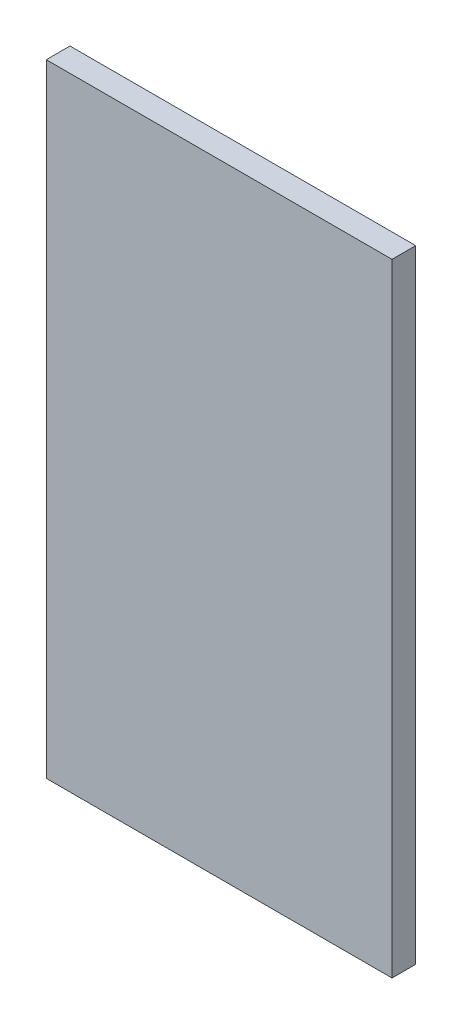
ISO-10303-21;
HEADER;
FILE_DESCRIPTION(('STEP AP214'),'2;1');
FILE_NAME('part.step','',(''),(''),'','','');
FILE_SCHEMA(('AUTOMOTIVE_DESIGN { 1 0 10303 214 1 1 1 1 }'));
ENDSEC;
DATA;
#1=APPLICATION_CONTEXT('core data for automotive mechanical design processes');
#2=APPLICATION_PROTOCOL_DEFINITION('international standard','automotive_design',2000,#1);
#3=PRODUCT_CONTEXT('',#1,'mechanical');
#4=PRODUCT('Part','Part','',(#3));
#5=PRODUCT_RELATED_PRODUCT_CATEGORY('part','',(#4));
#6=PRODUCT_DEFINITION_FORMATION('','',#4);
#7=PRODUCT_DEFINITION_CONTEXT('part definition',#1,'design');
#8=PRODUCT_DEFINITION('design','',#6,#7);
#9=PRODUCT_DEFINITION_SHAPE('','',#8);
#10=(LENGTH_UNIT() NAMED_UNIT(*) SI_UNIT(.MILLI.,.METRE.));
#11=(NAMED_UNIT(*) PLANE_ANGLE_UNIT() SI_UNIT($,.RADIAN.));
#12=(NAMED_UNIT(*) SI_UNIT($,.STERADIAN.) SOLID_ANGLE_UNIT());
#13=UNCERTAINTY_MEASURE_WITH_UNIT(LENGTH_MEASURE(1.E-05),#10,'distance_accuracy_value','');
#14=(GEOMETRIC_REPRESENTATION_CONTEXT(3) GLOBAL_UNCERTAINTY_ASSIGNED_CONTEXT((#13)) GLOBAL_UNIT_ASSIGNED_CONTEXT((#10,
#11,#12)) REPRESENTATION_CONTEXT('',''));
#15=CARTESIAN_POINT('',(0.,0.,0.));
#16=DIRECTION('',(0.,0.,1.));
#17=DIRECTION('',(1.,0.,0.));
#18=AXIS2_PLACEMENT_3D('',#15,#16,#17);
#19=CARTESIAN_POINT('',(9.80008,0.7,0.));
#20=DIRECTION('',(0.,0.,-1.));
#21=DIRECTION('',(-1.,0.,0.));
#22=AXIS2_PLACEMENT_3D('',#19,#20,#21);
#23=PLANE('',#22);
#24=DIRECTION('',(1.,0.,0.));
#25=VECTOR('',#24,1.);
#26=CARTESIAN_POINT('',(9.55008,1.15,0.));
#27=LINE('',#26,#25);
#28=CARTESIAN_POINT('',(9.55008,1.15,0.));
#29=VERTEX_POINT('',#28);
#30=CARTESIAN_POINT('',(10.05008,1.15,0.));
#31=VERTEX_POINT('',#30);
#32=EDGE_CURVE('E55',#29,#31,#27,.T.);
#33=ORIENTED_EDGE('',*,*,#32,.T.);
#34=DIRECTION('',(0.,1.,0.));
#35=VECTOR('',#34,1.);
#36=CARTESIAN_POINT('',(10.05008,1.15,0.));
#37=LINE('',#36,#35);
#38=CARTESIAN_POINT('',(10.05008,0.25,0.));
#39=VERTEX_POINT('',#38);
#40=EDGE_CURVE('E57',#31,#39,#37,.F.);
#41=ORIENTED_EDGE('',*,*,#40,.T.);
#42=DIRECTION('',(1.,0.,0.));
#43=VECTOR('',#42,1.);
#44=CARTESIAN_POINT('',(10.05008,0.25,0.));
#45=LINE('',#44,#43);
#46=CARTESIAN_POINT('',(9.55008,0.25,0.));
#47=VERTEX_POINT('',#46);
#48=EDGE_CURVE('E20',#39,#47,#45,.F.);
#49=ORIENTED_EDGE('',*,*,#48,.T.);
#50=DIRECTION('',(0.,1.,0.));
#51=VECTOR('',#50,1.);
#52=CARTESIAN_POINT('',(9.55008,0.25,0.));
#53=LINE('',#52,#51);
#54=EDGE_CURVE('E80',#47,#29,#53,.T.);
#55=ORIENTED_EDGE('',*,*,#54,.T.);
#56=EDGE_LOOP('',(#33,#41,#49,#55));
#57=FACE_BOUND('',#56,.T.);
#58=ADVANCED_FACE('F17',(#57),#23,.T.);
#59=CARTESIAN_POINT('',(10.05008,0.25,0.));
#60=DIRECTION('',(0.,1.,0.));
#61=DIRECTION('',(0.,0.,1.));
#62=AXIS2_PLACEMENT_3D('',#59,#60,#61);
#63=PLANE('',#62);
#64=DIRECTION('',(0.,0.,-1.));
#65=VECTOR('',#64,1.);
#66=CARTESIAN_POINT('',(9.55008,0.25,0.));
#67=LINE('',#66,#65);
#68=CARTESIAN_POINT('',(9.55008,0.25,0.03429));
#69=VERTEX_POINT('',#68);
#70=EDGE_CURVE('E68',#69,#47,#67,.T.);
#71=ORIENTED_EDGE('',*,*,#70,.T.);
#72=ORIENTED_EDGE('',*,*,#48,.F.);
#73=DIRECTION('',(0.,0.,1.));
#74=VECTOR('',#73,1.);
#75=CARTESIAN_POINT('',(10.05008,0.25,0.));
#76=LINE('',#75,#74);
#77=CARTESIAN_POINT('',(10.05008,0.25,0.03429));
#78=VERTEX_POINT('',#77);
#79=EDGE_CURVE('E63',#39,#78,#76,.T.);
#80=ORIENTED_EDGE('',*,*,#79,.T.);
#81=DIRECTION('',(1.,0.,0.));
#82=VECTOR('',#81,1.);
#83=CARTESIAN_POINT('',(9.80008,0.25,0.03429));
#84=LINE('',#83,#82);
#85=EDGE_CURVE('E83',#69,#78,#84,.T.);
#86=ORIENTED_EDGE('',*,*,#85,.F.);
#87=EDGE_LOOP('',(#71,#72,#80,#86));
#88=FACE_BOUND('',#87,.T.);
#89=ADVANCED_FACE('F65',(#88),#63,.F.);
#90=CARTESIAN_POINT('',(10.05008,1.15,0.));
#91=DIRECTION('',(-1.,0.,0.));
#92=DIRECTION('',(0.,0.,1.));
#93=AXIS2_PLACEMENT_3D('',#90,#91,#92);
#94=PLANE('',#93);
#95=ORIENTED_EDGE('',*,*,#79,.F.);
#96=ORIENTED_EDGE('',*,*,#40,.F.);
#97=DIRECTION('',(0.,0.,-1.));
#98=VECTOR('',#97,1.);
#99=CARTESIAN_POINT('',(10.05008,1.15,0.));
#100=LINE('',#99,#98);
#101=CARTESIAN_POINT('',(10.05008,1.15,0.03429));
#102=VERTEX_POINT('',#101);
#103=EDGE_CURVE('E75',#31,#102,#100,.F.);
#104=ORIENTED_EDGE('',*,*,#103,.T.);
#105=DIRECTION('',(0.,1.,0.));
#106=VECTOR('',#105,1.);
#107=CARTESIAN_POINT('',(10.05008,0.7,0.03429));
#108=LINE('',#107,#106);
#109=EDGE_CURVE('E72',#78,#102,#108,.T.);
#110=ORIENTED_EDGE('',*,*,#109,.F.);
#111=EDGE_LOOP('',(#95,#96,#104,#110));
#112=FACE_BOUND('',#111,.T.);
#113=ADVANCED_FACE('F70',(#112),#94,.F.);
#114=CARTESIAN_POINT('',(9.55008,1.15,0.));
#115=DIRECTION('',(0.,-1.,0.));
#116=DIRECTION('',(0.,0.,-1.));
#117=AXIS2_PLACEMENT_3D('',#114,#115,#116);
#118=PLANE('',#117);
#119=ORIENTED_EDGE('',*,*,#103,.F.);
#120=ORIENTED_EDGE('',*,*,#32,.F.);
#121=DIRECTION('',(0.,0.,-1.));
#122=VECTOR('',#121,1.);
#123=CARTESIAN_POINT('',(9.55008,1.15,0.));
#124=LINE('',#123,#122);
#125=CARTESIAN_POINT('',(9.55008,1.15,0.03429));
#126=VERTEX_POINT('',#125);
#127=EDGE_CURVE('E35',#29,#126,#124,.F.);
#128=ORIENTED_EDGE('',*,*,#127,.T.);
#129=DIRECTION('',(1.,0.,0.));
#130=VECTOR('',#129,1.);
#131=CARTESIAN_POINT('',(9.80008,1.15,0.03429));
#132=LINE('',#131,#130);
#133=EDGE_CURVE('E26',#102,#126,#132,.F.);
#134=ORIENTED_EDGE('',*,*,#133,.F.);
#135=EDGE_LOOP('',(#119,#120,#128,#134));
#136=FACE_BOUND('',#135,.T.);
#137=ADVANCED_FACE('F89',(#136),#118,.F.);
#138=CARTESIAN_POINT('',(9.55008,0.25,0.));
#139=DIRECTION('',(1.,0.,0.));
#140=DIRECTION('',(0.,0.,-1.));
#141=AXIS2_PLACEMENT_3D('',#138,#139,#140);
#142=PLANE('',#141);
#143=ORIENTED_EDGE('',*,*,#127,.F.);
#144=ORIENTED_EDGE('',*,*,#54,.F.);
#145=ORIENTED_EDGE('',*,*,#70,.F.);
#146=DIRECTION('',(0.,1.,0.));
#147=VECTOR('',#146,1.);
#148=CARTESIAN_POINT('',(9.55008,0.7,0.03429));
#149=LINE('',#148,#147);
#150=EDGE_CURVE('E11',#126,#69,#149,.F.);
#151=ORIENTED_EDGE('',*,*,#150,.F.);
#152=EDGE_LOOP('',(#143,#144,#145,#151));
#153=FACE_BOUND('',#152,.T.);
#154=ADVANCED_FACE('F91',(#153),#142,.F.);
#155=CARTESIAN_POINT('',(9.80008,0.7,0.03429));
#156=DIRECTION('',(0.,0.,1.));
#157=DIRECTION('',(1.,0.,0.));
#158=AXIS2_PLACEMENT_3D('',#155,#156,#157);
#159=PLANE('',#158);
#160=ORIENTED_EDGE('',*,*,#133,.T.);
#161=ORIENTED_EDGE('',*,*,#150,.T.);
#162=ORIENTED_EDGE('',*,*,#85,.T.);
#163=ORIENTED_EDGE('',*,*,#109,.T.);
#164=EDGE_LOOP('',(#160,#161,#162,#163));
#165=FACE_BOUND('',#164,.T.);
#166=ADVANCED_FACE('F88',(#165),#159,.T.);
#167=CLOSED_SHELL('',(#58,#89,#113,#137,#154,#166));
#168=MANIFOLD_SOLID_BREP('B1',#167);
#169=ADVANCED_BREP_SHAPE_REPRESENTATION('',(#18,#168),#14);
#170=SHAPE_DEFINITION_REPRESENTATION(#9,#169);
ENDSEC;
END-ISO-10303-21;
